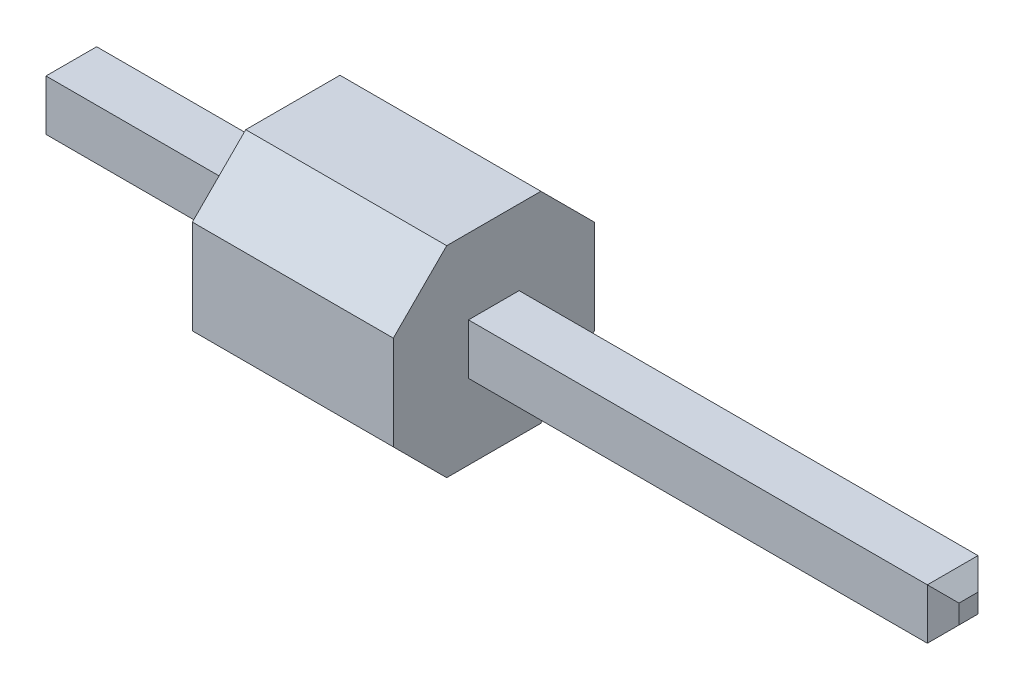
ISO-10303-21;
HEADER;
FILE_DESCRIPTION(('STEP AP214'),'2;1');
FILE_NAME('part.step','',(''),(''),'','','');
FILE_SCHEMA(('AUTOMOTIVE_DESIGN { 1 0 10303 214 1 1 1 1 }'));
ENDSEC;
DATA;
#1=APPLICATION_CONTEXT('core data for automotive mechanical design processes');
#2=APPLICATION_PROTOCOL_DEFINITION('international standard','automotive_design',2000,#1);
#3=PRODUCT_CONTEXT('',#1,'mechanical');
#4=PRODUCT('Part','Part','',(#3));
#5=PRODUCT_RELATED_PRODUCT_CATEGORY('part','',(#4));
#6=PRODUCT_DEFINITION_FORMATION('','',#4);
#7=PRODUCT_DEFINITION_CONTEXT('part definition',#1,'design');
#8=PRODUCT_DEFINITION('design','',#6,#7);
#9=PRODUCT_DEFINITION_SHAPE('','',#8);
#10=(LENGTH_UNIT() NAMED_UNIT(*) SI_UNIT(.MILLI.,.METRE.));
#11=(NAMED_UNIT(*) PLANE_ANGLE_UNIT() SI_UNIT($,.RADIAN.));
#12=(NAMED_UNIT(*) SI_UNIT($,.STERADIAN.) SOLID_ANGLE_UNIT());
#13=UNCERTAINTY_MEASURE_WITH_UNIT(LENGTH_MEASURE(1.E-05),#10,'distance_accuracy_value','');
#14=(GEOMETRIC_REPRESENTATION_CONTEXT(3) GLOBAL_UNCERTAINTY_ASSIGNED_CONTEXT((#13)) GLOBAL_UNIT_ASSIGNED_CONTEXT((#10,
#11,#12)) REPRESENTATION_CONTEXT('',''));
#15=CARTESIAN_POINT('',(0.,0.,0.));
#16=DIRECTION('',(0.,0.,1.));
#17=DIRECTION('',(1.,0.,0.));
#18=AXIS2_PLACEMENT_3D('',#15,#16,#17);
#19=CARTESIAN_POINT('',(-2.8,-0.32,-0.32));
#20=DIRECTION('',(0.707106781186548,0.,0.707106781186548));
#21=DIRECTION('',(0.707106781186548,0.,-0.707106781186548));
#22=AXIS2_PLACEMENT_3D('',#19,#20,#21);
#23=PLANE('',#22);
#24=DIRECTION('',(0.,1.,0.));
#25=VECTOR('',#24,1.);
#26=CARTESIAN_POINT('',(-2.8,-0.32,-0.32));
#27=LINE('',#26,#25);
#28=CARTESIAN_POINT('',(-2.8,-0.32,-0.32));
#29=VERTEX_POINT('',#28);
#30=CARTESIAN_POINT('',(-2.8,0.32,-0.32));
#31=VERTEX_POINT('',#30);
#32=EDGE_CURVE('P0_E104',#29,#31,#27,.T.);
#33=ORIENTED_EDGE('',*,*,#32,.F.);
#34=DIRECTION('',(-0.577350269189626,0.577350269189626,0.577350269189626));
#35=VECTOR('',#34,1.);
#36=CARTESIAN_POINT('',(-2.8,-0.32,-0.32));
#37=LINE('',#36,#35);
#38=CARTESIAN_POINT('',(-3.,-0.12,-0.12));
#39=VERTEX_POINT('',#38);
#40=EDGE_CURVE('P0_E79',#29,#39,#37,.T.);
#41=ORIENTED_EDGE('',*,*,#40,.T.);
#42=DIRECTION('',(0.,1.,0.));
#43=VECTOR('',#42,1.);
#44=CARTESIAN_POINT('',(-3.,0.,-0.12));
#45=LINE('',#44,#43);
#46=CARTESIAN_POINT('',(-3.,0.12,-0.12));
#47=VERTEX_POINT('',#46);
#48=EDGE_CURVE('P0_E20',#47,#39,#45,.F.);
#49=ORIENTED_EDGE('',*,*,#48,.F.);
#50=DIRECTION('',(0.577350269189626,0.577350269189626,-0.577350269189626));
#51=VECTOR('',#50,1.);
#52=CARTESIAN_POINT('',(-3.,0.12,-0.12));
#53=LINE('',#52,#51);
#54=EDGE_CURVE('P0_E83',#47,#31,#53,.T.);
#55=ORIENTED_EDGE('',*,*,#54,.T.);
#56=EDGE_LOOP('',(#33,#41,#49,#55));
#57=FACE_BOUND('',#56,.T.);
#58=ADVANCED_FACE('P0_F17',(#57),#23,.F.);
#59=CARTESIAN_POINT('',(8.54,0.,-0.12));
#60=DIRECTION('',(0.707106781186548,0.,-0.707106781186548));
#61=DIRECTION('',(-0.707106781186548,0.,-0.707106781186548));
#62=AXIS2_PLACEMENT_3D('',#59,#60,#61);
#63=PLANE('',#62);
#64=DIRECTION('',(-0.577350269189624,0.577350269189625,-0.577350269189628));
#65=VECTOR('',#64,1.);
#66=CARTESIAN_POINT('',(8.54,0.12,-0.12));
#67=LINE('',#66,#65);
#68=CARTESIAN_POINT('',(8.54,0.12,-0.12));
#69=VERTEX_POINT('',#68);
#70=CARTESIAN_POINT('',(8.34,0.32,-0.32));
#71=VERTEX_POINT('',#70);
#72=EDGE_CURVE('P0_E116',#69,#71,#67,.T.);
#73=ORIENTED_EDGE('',*,*,#72,.F.);
#74=DIRECTION('',(0.,1.,0.));
#75=VECTOR('',#74,1.);
#76=CARTESIAN_POINT('',(8.54,0.,-0.12));
#77=LINE('',#76,#75);
#78=CARTESIAN_POINT('',(8.54,-0.12,-0.12));
#79=VERTEX_POINT('',#78);
#80=EDGE_CURVE('P0_E113',#69,#79,#77,.F.);
#81=ORIENTED_EDGE('',*,*,#80,.T.);
#82=DIRECTION('',(0.577350269189624,0.577350269189625,0.577350269189628));
#83=VECTOR('',#82,1.);
#84=CARTESIAN_POINT('',(8.34,-0.319999999999999,-0.32));
#85=LINE('',#84,#83);
#86=CARTESIAN_POINT('',(8.34,-0.32,-0.32));
#87=VERTEX_POINT('',#86);
#88=EDGE_CURVE('P0_E109',#87,#79,#85,.T.);
#89=ORIENTED_EDGE('',*,*,#88,.F.);
#90=DIRECTION('',(0.,1.,0.));
#91=VECTOR('',#90,1.);
#92=CARTESIAN_POINT('',(8.34,-0.32,-0.32));
#93=LINE('',#92,#91);
#94=EDGE_CURVE('P0_E106',#71,#87,#93,.F.);
#95=ORIENTED_EDGE('',*,*,#94,.F.);
#96=EDGE_LOOP('',(#73,#81,#89,#95));
#97=FACE_BOUND('',#96,.T.);
#98=ADVANCED_FACE('P0_F182',(#97),#63,.T.);
#99=CARTESIAN_POINT('',(-3.,0.,0.));
#100=DIRECTION('',(-1.,0.,0.));
#101=DIRECTION('',(0.,0.,1.));
#102=AXIS2_PLACEMENT_3D('',#99,#100,#101);
#103=PLANE('',#102);
#104=DIRECTION('',(0.,1.,0.));
#105=VECTOR('',#104,1.);
#106=CARTESIAN_POINT('',(-3.,-0.32,0.12));
#107=LINE('',#106,#105);
#108=CARTESIAN_POINT('',(-3.,-0.12,0.12));
#109=VERTEX_POINT('',#108);
#110=CARTESIAN_POINT('',(-3.,0.12,0.12));
#111=VERTEX_POINT('',#110);
#112=EDGE_CURVE('P0_E91',#109,#111,#107,.T.);
#113=ORIENTED_EDGE('',*,*,#112,.T.);
#114=DIRECTION('',(0.,0.,1.));
#115=VECTOR('',#114,1.);
#116=CARTESIAN_POINT('',(-3.,0.12,0.32));
#117=LINE('',#116,#115);
#118=EDGE_CURVE('P0_E87',#111,#47,#117,.F.);
#119=ORIENTED_EDGE('',*,*,#118,.T.);
#120=ORIENTED_EDGE('',*,*,#48,.T.);
#121=DIRECTION('',(0.,0.,1.));
#122=VECTOR('',#121,1.);
#123=CARTESIAN_POINT('',(-3.,-0.12,0.32));
#124=LINE('',#123,#122);
#125=EDGE_CURVE('P0_E100',#39,#109,#124,.T.);
#126=ORIENTED_EDGE('',*,*,#125,.T.);
#127=EDGE_LOOP('',(#113,#119,#120,#126));
#128=FACE_BOUND('',#127,.T.);
#129=ADVANCED_FACE('P0_F89',(#128),#103,.T.);
#130=CARTESIAN_POINT('',(-2.8,0.32,0.32));
#131=DIRECTION('',(0.707106781186548,-0.707106781186548,0.));
#132=DIRECTION('',(0.707106781186548,0.707106781186548,0.));
#133=AXIS2_PLACEMENT_3D('',#130,#131,#132);
#134=PLANE('',#133);
#135=ORIENTED_EDGE('',*,*,#118,.F.);
#136=DIRECTION('',(0.577350269189626,0.577350269189626,0.577350269189626));
#137=VECTOR('',#136,1.);
#138=CARTESIAN_POINT('',(-3.,0.12,0.12));
#139=LINE('',#138,#137);
#140=CARTESIAN_POINT('',(-2.8,0.32,0.32));
#141=VERTEX_POINT('',#140);
#142=EDGE_CURVE('P0_E132',#111,#141,#139,.T.);
#143=ORIENTED_EDGE('',*,*,#142,.T.);
#144=DIRECTION('',(0.,0.,1.));
#145=VECTOR('',#144,1.);
#146=CARTESIAN_POINT('',(-2.8,0.32,0.32));
#147=LINE('',#146,#145);
#148=EDGE_CURVE('P0_E97',#31,#141,#147,.T.);
#149=ORIENTED_EDGE('',*,*,#148,.F.);
#150=ORIENTED_EDGE('',*,*,#54,.F.);
#151=EDGE_LOOP('',(#135,#143,#149,#150));
#152=FACE_BOUND('',#151,.T.);
#153=ADVANCED_FACE('P0_F95',(#152),#134,.F.);
#154=CARTESIAN_POINT('',(-2.8,-0.32,0.32));
#155=DIRECTION('',(0.707106781186548,0.707106781186548,0.));
#156=DIRECTION('',(-0.707106781186548,0.707106781186548,0.));
#157=AXIS2_PLACEMENT_3D('',#154,#155,#156);
#158=PLANE('',#157);
#159=ORIENTED_EDGE('',*,*,#125,.F.);
#160=ORIENTED_EDGE('',*,*,#40,.F.);
#161=DIRECTION('',(0.,0.,-1.));
#162=VECTOR('',#161,1.);
#163=CARTESIAN_POINT('',(-2.8,-0.32,0.32));
#164=LINE('',#163,#162);
#165=CARTESIAN_POINT('',(-2.8,-0.32,0.32));
#166=VERTEX_POINT('',#165);
#167=EDGE_CURVE('P0_E134',#166,#29,#164,.T.);
#168=ORIENTED_EDGE('',*,*,#167,.F.);
#169=DIRECTION('',(-0.577350269189626,0.577350269189626,-0.577350269189626));
#170=VECTOR('',#169,1.);
#171=CARTESIAN_POINT('',(-2.8,-0.32,0.32));
#172=LINE('',#171,#170);
#173=EDGE_CURVE('P0_E128',#166,#109,#172,.T.);
#174=ORIENTED_EDGE('',*,*,#173,.T.);
#175=EDGE_LOOP('',(#159,#160,#168,#174));
#176=FACE_BOUND('',#175,.T.);
#177=ADVANCED_FACE('P0_F178',(#176),#158,.F.);
#178=CARTESIAN_POINT('',(-3.,-0.32,-0.32));
#179=DIRECTION('',(0.,0.,-1.));
#180=DIRECTION('',(-1.,0.,0.));
#181=AXIS2_PLACEMENT_3D('',#178,#179,#180);
#182=PLANE('',#181);
#183=DIRECTION('',(1.,0.,0.));
#184=VECTOR('',#183,1.);
#185=CARTESIAN_POINT('',(-3.,0.32,-0.32));
#186=LINE('',#185,#184);
#187=EDGE_CURVE('P0_E122',#71,#31,#186,.F.);
#188=ORIENTED_EDGE('',*,*,#187,.F.);
#189=ORIENTED_EDGE('',*,*,#94,.T.);
#190=DIRECTION('',(1.,0.,0.));
#191=VECTOR('',#190,1.);
#192=CARTESIAN_POINT('',(-3.,-0.32,-0.32));
#193=LINE('',#192,#191);
#194=EDGE_CURVE('P0_E137',#29,#87,#193,.T.);
#195=ORIENTED_EDGE('',*,*,#194,.F.);
#196=ORIENTED_EDGE('',*,*,#32,.T.);
#197=EDGE_LOOP('',(#188,#189,#195,#196));
#198=FACE_BOUND('',#197,.T.);
#199=ADVANCED_FACE('P0_F180',(#198),#182,.T.);
#200=CARTESIAN_POINT('',(8.54,-0.12,0.));
#201=DIRECTION('',(0.707106781186548,-0.707106781186548,0.));
#202=DIRECTION('',(0.707106781186548,0.707106781186548,0.));
#203=AXIS2_PLACEMENT_3D('',#200,#201,#202);
#204=PLANE('',#203);
#205=ORIENTED_EDGE('',*,*,#88,.T.);
#206=DIRECTION('',(0.,0.,1.));
#207=VECTOR('',#206,1.);
#208=CARTESIAN_POINT('',(8.54,-0.12,0.));
#209=LINE('',#208,#207);
#210=CARTESIAN_POINT('',(8.54,-0.12,0.12));
#211=VERTEX_POINT('',#210);
#212=EDGE_CURVE('P0_E111',#79,#211,#209,.T.);
#213=ORIENTED_EDGE('',*,*,#212,.T.);
#214=DIRECTION('',(0.577350269189624,0.577350269189628,-0.577350269189625));
#215=VECTOR('',#214,1.);
#216=CARTESIAN_POINT('',(8.34,-0.32,0.319999999999999));
#217=LINE('',#216,#215);
#218=CARTESIAN_POINT('',(8.34,-0.32,0.32));
#219=VERTEX_POINT('',#218);
#220=EDGE_CURVE('P0_E35',#219,#211,#217,.T.);
#221=ORIENTED_EDGE('',*,*,#220,.F.);
#222=DIRECTION('',(0.,0.,-1.));
#223=VECTOR('',#222,1.);
#224=CARTESIAN_POINT('',(8.34,-0.32,0.32));
#225=LINE('',#224,#223);
#226=EDGE_CURVE('P0_E140',#87,#219,#225,.F.);
#227=ORIENTED_EDGE('',*,*,#226,.F.);
#228=EDGE_LOOP('',(#205,#213,#221,#227));
#229=FACE_BOUND('',#228,.T.);
#230=ADVANCED_FACE('P0_F185',(#229),#204,.T.);
#231=CARTESIAN_POINT('',(8.54,0.,0.));
#232=DIRECTION('',(-1.,0.,0.));
#233=DIRECTION('',(0.,0.,1.));
#234=AXIS2_PLACEMENT_3D('',#231,#232,#233);
#235=PLANE('',#234);
#236=DIRECTION('',(0.,0.,1.));
#237=VECTOR('',#236,1.);
#238=CARTESIAN_POINT('',(8.54,0.12,0.));
#239=LINE('',#238,#237);
#240=CARTESIAN_POINT('',(8.54,0.12,0.12));
#241=VERTEX_POINT('',#240);
#242=EDGE_CURVE('P0_E119',#241,#69,#239,.F.);
#243=ORIENTED_EDGE('',*,*,#242,.F.);
#244=DIRECTION('',(0.,1.,0.));
#245=VECTOR('',#244,1.);
#246=CARTESIAN_POINT('',(8.54,0.,0.12));
#247=LINE('',#246,#245);
#248=EDGE_CURVE('P0_E143',#211,#241,#247,.T.);
#249=ORIENTED_EDGE('',*,*,#248,.F.);
#250=ORIENTED_EDGE('',*,*,#212,.F.);
#251=ORIENTED_EDGE('',*,*,#80,.F.);
#252=EDGE_LOOP('',(#243,#249,#250,#251));
#253=FACE_BOUND('',#252,.T.);
#254=ADVANCED_FACE('P0_F187',(#253),#235,.F.);
#255=CARTESIAN_POINT('',(8.54,0.12,0.));
#256=DIRECTION('',(0.707106781186548,0.707106781186548,0.));
#257=DIRECTION('',(-0.707106781186548,0.707106781186548,0.));
#258=AXIS2_PLACEMENT_3D('',#255,#256,#257);
#259=PLANE('',#258);
#260=DIRECTION('',(-0.577350269189624,0.577350269189628,0.577350269189625));
#261=VECTOR('',#260,1.);
#262=CARTESIAN_POINT('',(8.54,0.12,0.12));
#263=LINE('',#262,#261);
#264=CARTESIAN_POINT('',(8.34,0.32,0.32));
#265=VERTEX_POINT('',#264);
#266=EDGE_CURVE('P0_E146',#241,#265,#263,.T.);
#267=ORIENTED_EDGE('',*,*,#266,.F.);
#268=ORIENTED_EDGE('',*,*,#242,.T.);
#269=ORIENTED_EDGE('',*,*,#72,.T.);
#270=DIRECTION('',(0.,0.,1.));
#271=VECTOR('',#270,1.);
#272=CARTESIAN_POINT('',(8.34,0.32,0.32));
#273=LINE('',#272,#271);
#274=EDGE_CURVE('P0_E125',#265,#71,#273,.F.);
#275=ORIENTED_EDGE('',*,*,#274,.F.);
#276=EDGE_LOOP('',(#267,#268,#269,#275));
#277=FACE_BOUND('',#276,.T.);
#278=ADVANCED_FACE('P0_F169',(#277),#259,.T.);
#279=CARTESIAN_POINT('',(-3.,0.32,0.32));
#280=DIRECTION('',(0.,1.,0.));
#281=DIRECTION('',(0.,0.,1.));
#282=AXIS2_PLACEMENT_3D('',#279,#280,#281);
#283=PLANE('',#282);
#284=DIRECTION('',(1.,0.,0.));
#285=VECTOR('',#284,1.);
#286=CARTESIAN_POINT('',(-3.,0.32,0.32));
#287=LINE('',#286,#285);
#288=EDGE_CURVE('P0_E149',#265,#141,#287,.F.);
#289=ORIENTED_EDGE('',*,*,#288,.F.);
#290=ORIENTED_EDGE('',*,*,#274,.T.);
#291=ORIENTED_EDGE('',*,*,#187,.T.);
#292=ORIENTED_EDGE('',*,*,#148,.T.);
#293=EDGE_LOOP('',(#289,#290,#291,#292));
#294=FACE_BOUND('',#293,.T.);
#295=ADVANCED_FACE('P0_F172',(#294),#283,.T.);
#296=CARTESIAN_POINT('',(-2.8,-0.32,0.32));
#297=DIRECTION('',(0.707106781186548,0.,-0.707106781186548));
#298=DIRECTION('',(-0.707106781186548,0.,-0.707106781186548));
#299=AXIS2_PLACEMENT_3D('',#296,#297,#298);
#300=PLANE('',#299);
#301=ORIENTED_EDGE('',*,*,#112,.F.);
#302=ORIENTED_EDGE('',*,*,#173,.F.);
#303=DIRECTION('',(0.,1.,0.));
#304=VECTOR('',#303,1.);
#305=CARTESIAN_POINT('',(-2.8,-0.32,0.32));
#306=LINE('',#305,#304);
#307=EDGE_CURVE('P0_E152',#141,#166,#306,.F.);
#308=ORIENTED_EDGE('',*,*,#307,.F.);
#309=ORIENTED_EDGE('',*,*,#142,.F.);
#310=EDGE_LOOP('',(#301,#302,#308,#309));
#311=FACE_BOUND('',#310,.T.);
#312=ADVANCED_FACE('P0_F176',(#311),#300,.F.);
#313=CARTESIAN_POINT('',(-3.,-0.32,0.32));
#314=DIRECTION('',(0.,-1.,0.));
#315=DIRECTION('',(0.,0.,-1.));
#316=AXIS2_PLACEMENT_3D('',#313,#314,#315);
#317=PLANE('',#316);
#318=ORIENTED_EDGE('',*,*,#194,.T.);
#319=ORIENTED_EDGE('',*,*,#226,.T.);
#320=DIRECTION('',(1.,0.,0.));
#321=VECTOR('',#320,1.);
#322=CARTESIAN_POINT('',(-3.,-0.32,0.32));
#323=LINE('',#322,#321);
#324=EDGE_CURVE('P0_E26',#166,#219,#323,.T.);
#325=ORIENTED_EDGE('',*,*,#324,.F.);
#326=ORIENTED_EDGE('',*,*,#167,.T.);
#327=EDGE_LOOP('',(#318,#319,#325,#326));
#328=FACE_BOUND('',#327,.T.);
#329=ADVANCED_FACE('P0_F162',(#328),#317,.T.);
#330=CARTESIAN_POINT('',(8.54,0.,0.12));
#331=DIRECTION('',(0.707106781186548,0.,0.707106781186548));
#332=DIRECTION('',(0.707106781186548,0.,-0.707106781186548));
#333=AXIS2_PLACEMENT_3D('',#330,#331,#332);
#334=PLANE('',#333);
#335=ORIENTED_EDGE('',*,*,#266,.T.);
#336=DIRECTION('',(0.,1.,0.));
#337=VECTOR('',#336,1.);
#338=CARTESIAN_POINT('',(8.34,-0.32,0.32));
#339=LINE('',#338,#337);
#340=EDGE_CURVE('P0_E11',#219,#265,#339,.T.);
#341=ORIENTED_EDGE('',*,*,#340,.F.);
#342=ORIENTED_EDGE('',*,*,#220,.T.);
#343=ORIENTED_EDGE('',*,*,#248,.T.);
#344=EDGE_LOOP('',(#335,#341,#342,#343));
#345=FACE_BOUND('',#344,.T.);
#346=ADVANCED_FACE('P0_F165',(#345),#334,.T.);
#347=CARTESIAN_POINT('',(-3.,-0.32,0.32));
#348=DIRECTION('',(0.,0.,1.));
#349=DIRECTION('',(1.,0.,0.));
#350=AXIS2_PLACEMENT_3D('',#347,#348,#349);
#351=PLANE('',#350);
#352=ORIENTED_EDGE('',*,*,#324,.T.);
#353=ORIENTED_EDGE('',*,*,#340,.T.);
#354=ORIENTED_EDGE('',*,*,#288,.T.);
#355=ORIENTED_EDGE('',*,*,#307,.T.);
#356=EDGE_LOOP('',(#352,#353,#354,#355));
#357=FACE_BOUND('',#356,.T.);
#358=ADVANCED_FACE('P0_F158',(#357),#351,.T.);
#359=CLOSED_SHELL('',(#58,#98,#129,#153,#177,#199,#230,#254,#278,#295,#312,#329,#346,#358));
#360=MANIFOLD_SOLID_BREP('P0_B1',#359);
#361=CARTESIAN_POINT('',(2.54,0.9327413415,0.9327413415));
#362=DIRECTION('',(0.,-0.707106781186548,-0.707106781186548));
#363=DIRECTION('',(0.,0.707106781186548,-0.707106781186548));
#364=AXIS2_PLACEMENT_3D('',#361,#362,#363);
#365=PLANE('',#364);
#366=DIRECTION('',(-1.,0.,0.));
#367=VECTOR('',#366,1.);
#368=CARTESIAN_POINT('',(2.54,0.595482683,1.27));
#369=LINE('',#368,#367);
#370=CARTESIAN_POINT('',(0.,0.595482683,1.27));
#371=VERTEX_POINT('',#370);
#372=CARTESIAN_POINT('',(2.54,0.595482683,1.27));
#373=VERTEX_POINT('',#372);
#374=EDGE_CURVE('P1_E168',#371,#373,#369,.F.);
#375=ORIENTED_EDGE('',*,*,#374,.T.);
#376=DIRECTION('',(0.,0.707106781186548,-0.707106781186548));
#377=VECTOR('',#376,1.);
#378=CARTESIAN_POINT('',(2.54,0.9327413415,0.9327413415));
#379=LINE('',#378,#377);
#380=CARTESIAN_POINT('',(2.54,1.27,0.595482683));
#381=VERTEX_POINT('',#380);
#382=EDGE_CURVE('P1_E150',#381,#373,#379,.F.);
#383=ORIENTED_EDGE('',*,*,#382,.F.);
#384=DIRECTION('',(1.,0.,0.));
#385=VECTOR('',#384,1.);
#386=CARTESIAN_POINT('',(2.54,1.27,0.595482683));
#387=LINE('',#386,#385);
#388=CARTESIAN_POINT('',(0.,1.27,0.595482683));
#389=VERTEX_POINT('',#388);
#390=EDGE_CURVE('P1_E163',#381,#389,#387,.F.);
#391=ORIENTED_EDGE('',*,*,#390,.T.);
#392=DIRECTION('',(0.,0.707106781186548,-0.707106781186548));
#393=VECTOR('',#392,1.);
#394=CARTESIAN_POINT('',(0.,0.9327413415,0.9327413415));
#395=LINE('',#394,#393);
#396=EDGE_CURVE('P1_E152',#371,#389,#395,.T.);
#397=ORIENTED_EDGE('',*,*,#396,.F.);
#398=EDGE_LOOP('',(#375,#383,#391,#397));
#399=FACE_BOUND('',#398,.T.);
#400=ADVANCED_FACE('P1_F16',(#399),#365,.F.);
#401=CARTESIAN_POINT('',(2.54,1.27,0.));
#402=DIRECTION('',(0.,-1.,0.));
#403=DIRECTION('',(0.,0.,-1.));
#404=AXIS2_PLACEMENT_3D('',#401,#402,#403);
#405=PLANE('',#404);
#406=ORIENTED_EDGE('',*,*,#390,.F.);
#407=DIRECTION('',(0.,0.,-1.));
#408=VECTOR('',#407,1.);
#409=CARTESIAN_POINT('',(2.54,1.27,0.));
#410=LINE('',#409,#408);
#411=CARTESIAN_POINT('',(2.54,1.27,-0.595482683));
#412=VERTEX_POINT('',#411);
#413=EDGE_CURVE('P1_E154',#412,#381,#410,.F.);
#414=ORIENTED_EDGE('',*,*,#413,.F.);
#415=DIRECTION('',(1.,0.,0.));
#416=VECTOR('',#415,1.);
#417=CARTESIAN_POINT('',(2.54,1.27,-0.595482683));
#418=LINE('',#417,#416);
#419=CARTESIAN_POINT('',(0.,1.27,-0.595482683));
#420=VERTEX_POINT('',#419);
#421=EDGE_CURVE('P1_E147',#412,#420,#418,.F.);
#422=ORIENTED_EDGE('',*,*,#421,.T.);
#423=DIRECTION('',(0.,0.,-1.));
#424=VECTOR('',#423,1.);
#425=CARTESIAN_POINT('',(0.,1.27,0.));
#426=LINE('',#425,#424);
#427=EDGE_CURVE('P1_E166',#389,#420,#426,.T.);
#428=ORIENTED_EDGE('',*,*,#427,.F.);
#429=EDGE_LOOP('',(#406,#414,#422,#428));
#430=FACE_BOUND('',#429,.T.);
#431=ADVANCED_FACE('P1_F330',(#430),#405,.F.);
#432=CARTESIAN_POINT('',(2.54,0.,1.27));
#433=DIRECTION('',(0.,0.,-1.));
#434=DIRECTION('',(-1.,0.,0.));
#435=AXIS2_PLACEMENT_3D('',#432,#433,#434);
#436=PLANE('',#435);
#437=DIRECTION('',(1.,0.,0.));
#438=VECTOR('',#437,1.);
#439=CARTESIAN_POINT('',(2.54,-0.595482683,1.27));
#440=LINE('',#439,#438);
#441=CARTESIAN_POINT('',(2.54,-0.595482683,1.27));
#442=VERTEX_POINT('',#441);
#443=CARTESIAN_POINT('',(0.,-0.595482683,1.27));
#444=VERTEX_POINT('',#443);
#445=EDGE_CURVE('P1_E207',#442,#444,#440,.F.);
#446=ORIENTED_EDGE('',*,*,#445,.F.);
#447=DIRECTION('',(0.,1.,0.));
#448=VECTOR('',#447,1.);
#449=CARTESIAN_POINT('',(2.54,0.,1.27));
#450=LINE('',#449,#448);
#451=EDGE_CURVE('P1_E181',#373,#442,#450,.F.);
#452=ORIENTED_EDGE('',*,*,#451,.F.);
#453=ORIENTED_EDGE('',*,*,#374,.F.);
#454=DIRECTION('',(0.,1.,0.));
#455=VECTOR('',#454,1.);
#456=CARTESIAN_POINT('',(0.,0.,1.27));
#457=LINE('',#456,#455);
#458=EDGE_CURVE('P1_E183',#444,#371,#457,.T.);
#459=ORIENTED_EDGE('',*,*,#458,.F.);
#460=EDGE_LOOP('',(#446,#452,#453,#459));
#461=FACE_BOUND('',#460,.T.);
#462=ADVANCED_FACE('P1_F337',(#461),#436,.F.);
#463=CARTESIAN_POINT('',(2.54,0.32,0.));
#464=DIRECTION('',(0.,-1.,0.));
#465=DIRECTION('',(0.,0.,-1.));
#466=AXIS2_PLACEMENT_3D('',#463,#464,#465);
#467=PLANE('',#466);
#468=DIRECTION('',(0.,0.,-1.));
#469=VECTOR('',#468,1.);
#470=CARTESIAN_POINT('',(2.54,0.32,0.));
#471=LINE('',#470,#469);
#472=CARTESIAN_POINT('',(2.54,0.32,-0.32));
#473=VERTEX_POINT('',#472);
#474=CARTESIAN_POINT('',(2.54,0.32,0.32));
#475=VERTEX_POINT('',#474);
#476=EDGE_CURVE('P1_E132',#473,#475,#471,.F.);
#477=ORIENTED_EDGE('',*,*,#476,.T.);
#478=DIRECTION('',(1.,0.,0.));
#479=VECTOR('',#478,1.);
#480=CARTESIAN_POINT('',(2.54,0.32,0.32));
#481=LINE('',#480,#479);
#482=CARTESIAN_POINT('',(0.,0.32,0.32));
#483=VERTEX_POINT('',#482);
#484=EDGE_CURVE('P1_E215',#483,#475,#481,.T.);
#485=ORIENTED_EDGE('',*,*,#484,.F.);
#486=DIRECTION('',(0.,0.,-1.));
#487=VECTOR('',#486,1.);
#488=CARTESIAN_POINT('',(0.,0.32,0.));
#489=LINE('',#488,#487);
#490=CARTESIAN_POINT('',(0.,0.32,-0.32));
#491=VERTEX_POINT('',#490);
#492=EDGE_CURVE('P1_E186',#483,#491,#489,.T.);
#493=ORIENTED_EDGE('',*,*,#492,.T.);
#494=DIRECTION('',(1.,0.,0.));
#495=VECTOR('',#494,1.);
#496=CARTESIAN_POINT('',(2.54,0.32,-0.32));
#497=LINE('',#496,#495);
#498=EDGE_CURVE('P1_E210',#491,#473,#497,.T.);
#499=ORIENTED_EDGE('',*,*,#498,.T.);
#500=EDGE_LOOP('',(#477,#485,#493,#499));
#501=FACE_BOUND('',#500,.T.);
#502=ADVANCED_FACE('P1_F277',(#501),#467,.T.);
#503=CARTESIAN_POINT('',(0.457528496239,2.54,-1.152068397165));
#504=DIRECTION('',(-0.410022520076835,0.,-0.912075398763634));
#505=DIRECTION('',(-0.912075398763634,0.,0.410022520076835));
#506=AXIS2_PLACEMENT_3D('',#503,#504,#505);
#507=PLANE('',#506);
#508=DIRECTION('',(-0.843892829702957,-0.379371119074516,0.379371119074826));
#509=VECTOR('',#508,1.);
#510=CARTESIAN_POINT('',(0.457528496239,-0.713414285835002,-1.152068397165));
#511=LINE('',#510,#509);
#512=CARTESIAN_POINT('',(0.457528496239304,-0.713414285834686,-1.15206839716538));
#513=VERTEX_POINT('',#512);
#514=CARTESIAN_POINT('',(0.,-0.919095732006001,-0.946386950993916));
#515=VERTEX_POINT('',#514);
#516=EDGE_CURVE('P1_E119',#513,#515,#511,.T.);
#517=ORIENTED_EDGE('',*,*,#516,.T.);
#518=DIRECTION('',(0.,1.,0.));
#519=VECTOR('',#518,1.);
#520=CARTESIAN_POINT('',(0.,0.,-0.946386950994));
#521=LINE('',#520,#519);
#522=CARTESIAN_POINT('',(0.,0.919095732006,-0.946386950994));
#523=VERTEX_POINT('',#522);
#524=EDGE_CURVE('P1_E158',#515,#523,#521,.T.);
#525=ORIENTED_EDGE('',*,*,#524,.T.);
#526=DIRECTION('',(0.843892829703096,-0.379371119074517,-0.379371119074517));
#527=VECTOR('',#526,1.);
#528=CARTESIAN_POINT('',(0.,0.919095732006,-0.946386950994));
#529=LINE('',#528,#527);
#530=CARTESIAN_POINT('',(0.457528496239294,0.713414285834689,-1.15206839716538));
#531=VERTEX_POINT('',#530);
#532=EDGE_CURVE('P1_E136',#523,#531,#529,.T.);
#533=ORIENTED_EDGE('',*,*,#532,.T.);
#534=DIRECTION('',(0.,-1.,0.));
#535=VECTOR('',#534,1.);
#536=CARTESIAN_POINT('',(0.457528496238877,2.54,-1.15206839716527));
#537=LINE('',#536,#535);
#538=EDGE_CURVE('P1_E131',#531,#513,#537,.T.);
#539=ORIENTED_EDGE('',*,*,#538,.T.);
#540=EDGE_LOOP('',(#517,#525,#533,#539));
#541=FACE_BOUND('',#540,.T.);
#542=ADVANCED_FACE('P1_F135',(#541),#507,.T.);
#543=CARTESIAN_POINT('',(0.416526244232,2.54,-1.243275937042));
#544=DIRECTION('',(0.,-1.,0.));
#545=DIRECTION('',(0.,0.,-1.));
#546=AXIS2_PLACEMENT_3D('',#543,#544,#545);
#547=CYLINDRICAL_SURFACE('',#546,0.1);
#548=DIRECTION('',(0.,1.,0.));
#549=VECTOR('',#548,1.);
#550=CARTESIAN_POINT('',(0.516526244232,2.54,-1.243275937042));
#551=LINE('',#550,#549);
#552=CARTESIAN_POINT('',(0.516526244232,-0.622206745958,-1.243275937042));
#553=VERTEX_POINT('',#552);
#554=CARTESIAN_POINT('',(0.516526244232,0.622206745958001,-1.243275937042));
#555=VERTEX_POINT('',#554);
#556=EDGE_CURVE('P1_E142',#553,#555,#551,.T.);
#557=ORIENTED_EDGE('',*,*,#556,.F.);
#558=CARTESIAN_POINT('',(0.416526244232,-0.622206745958,-1.243275937042));
#559=DIRECTION('',(0.,-0.707106781186548,-0.707106781186548));
#560=DIRECTION('',(0.,-0.707106781186548,0.707106781186548));
#561=AXIS2_PLACEMENT_3D('',#558,#559,#560);
#562=ELLIPSE('',#561,0.14142135623731,0.1);
#563=EDGE_CURVE('P1_E19',#513,#553,#562,.F.);
#564=ORIENTED_EDGE('',*,*,#563,.F.);
#565=ORIENTED_EDGE('',*,*,#538,.F.);
#566=CARTESIAN_POINT('',(0.416526244232,0.622206745958,-1.243275937042));
#567=DIRECTION('',(0.,-0.707106781186548,0.707106781186548));
#568=DIRECTION('',(0.,-0.707106781186548,-0.707106781186548));
#569=AXIS2_PLACEMENT_3D('',#566,#567,#568);
#570=ELLIPSE('',#569,0.14142135623731,0.1);
#571=EDGE_CURVE('P1_E144',#531,#555,#570,.F.);
#572=ORIENTED_EDGE('',*,*,#571,.T.);
#573=EDGE_LOOP('',(#557,#564,#565,#572));
#574=FACE_BOUND('',#573,.T.);
#575=ADVANCED_FACE('P1_F140',(#574),#547,.F.);
#576=CARTESIAN_POINT('',(2.54,0.9327413415,-0.9327413415));
#577=DIRECTION('',(0.,-0.707106781186548,0.707106781186548));
#578=DIRECTION('',(0.,-0.707106781186548,-0.707106781186548));
#579=AXIS2_PLACEMENT_3D('',#576,#577,#578);
#580=PLANE('',#579);
#581=DIRECTION('',(0.,0.707106781186547,0.707106781186548));
#582=VECTOR('',#581,1.);
#583=CARTESIAN_POINT('',(0.,0.919095732006,-0.946386950994));
#584=LINE('',#583,#582);
#585=EDGE_CURVE('P1_E171',#523,#420,#584,.T.);
#586=ORIENTED_EDGE('',*,*,#585,.T.);
#587=ORIENTED_EDGE('',*,*,#421,.F.);
#588=DIRECTION('',(0.,-0.707106781186548,-0.707106781186548));
#589=VECTOR('',#588,1.);
#590=CARTESIAN_POINT('',(2.54,0.9327413415,-0.9327413415));
#591=LINE('',#590,#589);
#592=CARTESIAN_POINT('',(2.54,0.595482683,-1.27));
#593=VERTEX_POINT('',#592);
#594=EDGE_CURVE('P1_E145',#593,#412,#591,.F.);
#595=ORIENTED_EDGE('',*,*,#594,.F.);
#596=DIRECTION('',(-1.,0.,0.));
#597=VECTOR('',#596,1.);
#598=CARTESIAN_POINT('',(2.54,0.595482683,-1.27));
#599=LINE('',#598,#597);
#600=CARTESIAN_POINT('',(0.516526244232,0.595482683,-1.27));
#601=VERTEX_POINT('',#600);
#602=EDGE_CURVE('P1_E191',#601,#593,#599,.F.);
#603=ORIENTED_EDGE('',*,*,#602,.F.);
#604=DIRECTION('',(0.,-0.707106781186545,-0.70710678118655));
#605=VECTOR('',#604,1.);
#606=CARTESIAN_POINT('',(0.516526244232,0.622206745958,-1.243275937042));
#607=LINE('',#606,#605);
#608=EDGE_CURVE('P1_E178',#555,#601,#607,.T.);
#609=ORIENTED_EDGE('',*,*,#608,.F.);
#610=ORIENTED_EDGE('',*,*,#571,.F.);
#611=ORIENTED_EDGE('',*,*,#532,.F.);
#612=EDGE_LOOP('',(#586,#587,#595,#603,#609,#610,#611));
#613=FACE_BOUND('',#612,.T.);
#614=ADVANCED_FACE('P1_F289',(#613),#580,.F.);
#615=CARTESIAN_POINT('',(2.54,-0.9327413415,0.9327413415));
#616=DIRECTION('',(0.,-0.707106781186548,0.707106781186548));
#617=DIRECTION('',(0.,-0.707106781186548,-0.707106781186548));
#618=AXIS2_PLACEMENT_3D('',#615,#616,#617);
#619=PLANE('',#618);
#620=DIRECTION('',(0.,-0.707106781186548,-0.707106781186548));
#621=VECTOR('',#620,1.);
#622=CARTESIAN_POINT('',(2.54,-0.9327413415,0.9327413415));
#623=LINE('',#622,#621);
#624=CARTESIAN_POINT('',(2.54,-1.27,0.595482683));
#625=VERTEX_POINT('',#624);
#626=EDGE_CURVE('P1_E204',#625,#442,#623,.F.);
#627=ORIENTED_EDGE('',*,*,#626,.T.);
#628=ORIENTED_EDGE('',*,*,#445,.T.);
#629=DIRECTION('',(0.,-0.707106781186548,-0.707106781186548));
#630=VECTOR('',#629,1.);
#631=CARTESIAN_POINT('',(0.,-0.595482683,1.27));
#632=LINE('',#631,#630);
#633=CARTESIAN_POINT('',(0.,-1.27,0.595482683));
#634=VERTEX_POINT('',#633);
#635=EDGE_CURVE('P1_E159',#444,#634,#632,.T.);
#636=ORIENTED_EDGE('',*,*,#635,.T.);
#637=DIRECTION('',(1.,0.,0.));
#638=VECTOR('',#637,1.);
#639=CARTESIAN_POINT('',(2.54,-1.27,0.595482683));
#640=LINE('',#639,#638);
#641=EDGE_CURVE('P1_E242',#625,#634,#640,.F.);
#642=ORIENTED_EDGE('',*,*,#641,.F.);
#643=EDGE_LOOP('',(#627,#628,#636,#642));
#644=FACE_BOUND('',#643,.T.);
#645=ADVANCED_FACE('P1_F281',(#644),#619,.T.);
#646=CARTESIAN_POINT('',(2.54,0.,-0.32));
#647=DIRECTION('',(0.,0.,-1.));
#648=DIRECTION('',(0.,1.,0.));
#649=AXIS2_PLACEMENT_3D('',#646,#647,#648);
#650=PLANE('',#649);
#651=DIRECTION('',(1.,0.,0.));
#652=VECTOR('',#651,1.);
#653=CARTESIAN_POINT('',(2.54,-0.32,-0.32));
#654=LINE('',#653,#652);
#655=CARTESIAN_POINT('',(0.,-0.32,-0.32));
#656=VERTEX_POINT('',#655);
#657=CARTESIAN_POINT('',(2.54,-0.32,-0.32));
#658=VERTEX_POINT('',#657);
#659=EDGE_CURVE('P1_E245',#656,#658,#654,.T.);
#660=ORIENTED_EDGE('',*,*,#659,.T.);
#661=DIRECTION('',(0.,1.,0.));
#662=VECTOR('',#661,1.);
#663=CARTESIAN_POINT('',(2.54,0.,-0.32));
#664=LINE('',#663,#662);
#665=EDGE_CURVE('P1_E213',#473,#658,#664,.F.);
#666=ORIENTED_EDGE('',*,*,#665,.F.);
#667=ORIENTED_EDGE('',*,*,#498,.F.);
#668=DIRECTION('',(0.,1.,0.));
#669=VECTOR('',#668,1.);
#670=CARTESIAN_POINT('',(0.,0.,-0.32));
#671=LINE('',#670,#669);
#672=EDGE_CURVE('P1_E220',#491,#656,#671,.F.);
#673=ORIENTED_EDGE('',*,*,#672,.T.);
#674=EDGE_LOOP('',(#660,#666,#667,#673));
#675=FACE_BOUND('',#674,.T.);
#676=ADVANCED_FACE('P1_F279',(#675),#650,.F.);
#677=CARTESIAN_POINT('',(2.54,0.,0.32));
#678=DIRECTION('',(0.,0.,-1.));
#679=DIRECTION('',(0.,1.,0.));
#680=AXIS2_PLACEMENT_3D('',#677,#678,#679);
#681=PLANE('',#680);
#682=DIRECTION('',(0.,1.,0.));
#683=VECTOR('',#682,1.);
#684=CARTESIAN_POINT('',(2.54,0.,0.32));
#685=LINE('',#684,#683);
#686=CARTESIAN_POINT('',(2.54,-0.32,0.32));
#687=VERTEX_POINT('',#686);
#688=EDGE_CURVE('P1_E218',#475,#687,#685,.F.);
#689=ORIENTED_EDGE('',*,*,#688,.T.);
#690=DIRECTION('',(1.,0.,0.));
#691=VECTOR('',#690,1.);
#692=CARTESIAN_POINT('',(2.54,-0.32,0.32));
#693=LINE('',#692,#691);
#694=CARTESIAN_POINT('',(0.,-0.32,0.32));
#695=VERTEX_POINT('',#694);
#696=EDGE_CURVE('P1_E248',#687,#695,#693,.F.);
#697=ORIENTED_EDGE('',*,*,#696,.T.);
#698=DIRECTION('',(0.,1.,0.));
#699=VECTOR('',#698,1.);
#700=CARTESIAN_POINT('',(0.,0.,0.32));
#701=LINE('',#700,#699);
#702=EDGE_CURVE('P1_E174',#695,#483,#701,.T.);
#703=ORIENTED_EDGE('',*,*,#702,.T.);
#704=ORIENTED_EDGE('',*,*,#484,.T.);
#705=EDGE_LOOP('',(#689,#697,#703,#704));
#706=FACE_BOUND('',#705,.T.);
#707=ADVANCED_FACE('P1_F270',(#706),#681,.T.);
#708=CARTESIAN_POINT('',(0.,0.,0.));
#709=DIRECTION('',(1.,0.,0.));
#710=DIRECTION('',(0.,0.,-1.));
#711=AXIS2_PLACEMENT_3D('',#708,#709,#710);
#712=PLANE('',#711);
#713=DIRECTION('',(0.,0.707106781186547,-0.707106781186548));
#714=VECTOR('',#713,1.);
#715=CARTESIAN_POINT('',(0.,-1.27,-0.595482683));
#716=LINE('',#715,#714);
#717=CARTESIAN_POINT('',(0.,-1.27,-0.595482683));
#718=VERTEX_POINT('',#717);
#719=EDGE_CURVE('P1_E127',#718,#515,#716,.T.);
#720=ORIENTED_EDGE('',*,*,#719,.F.);
#721=DIRECTION('',(0.,0.,-1.));
#722=VECTOR('',#721,1.);
#723=CARTESIAN_POINT('',(0.,-1.27,0.));
#724=LINE('',#723,#722);
#725=EDGE_CURVE('P1_E238',#634,#718,#724,.T.);
#726=ORIENTED_EDGE('',*,*,#725,.F.);
#727=ORIENTED_EDGE('',*,*,#635,.F.);
#728=ORIENTED_EDGE('',*,*,#458,.T.);
#729=ORIENTED_EDGE('',*,*,#396,.T.);
#730=ORIENTED_EDGE('',*,*,#427,.T.);
#731=ORIENTED_EDGE('',*,*,#585,.F.);
#732=ORIENTED_EDGE('',*,*,#524,.F.);
#733=EDGE_LOOP('',(#720,#726,#727,#728,#729,#730,#731,#732));
#734=FACE_BOUND('',#733,.T.);
#735=DIRECTION('',(0.,0.,-1.));
#736=VECTOR('',#735,1.);
#737=CARTESIAN_POINT('',(0.,-0.32,0.));
#738=LINE('',#737,#736);
#739=EDGE_CURVE('P1_E250',#695,#656,#738,.T.);
#740=ORIENTED_EDGE('',*,*,#739,.T.);
#741=ORIENTED_EDGE('',*,*,#672,.F.);
#742=ORIENTED_EDGE('',*,*,#492,.F.);
#743=ORIENTED_EDGE('',*,*,#702,.F.);
#744=EDGE_LOOP('',(#740,#741,#742,#743));
#745=FACE_BOUND('',#744,.T.);
#746=ADVANCED_FACE('P1_F272',(#734,#745),#712,.F.);
#747=CARTESIAN_POINT('',(0.516526244232,2.54,-1.243275937042));
#748=DIRECTION('',(-1.,0.,0.));
#749=DIRECTION('',(0.,0.,1.));
#750=AXIS2_PLACEMENT_3D('',#747,#748,#749);
#751=PLANE('',#750);
#752=DIRECTION('',(0.,0.707106781186548,-0.707106781186548));
#753=VECTOR('',#752,1.);
#754=CARTESIAN_POINT('',(0.516526244231999,-0.9327413415,-0.9327413415));
#755=LINE('',#754,#753);
#756=CARTESIAN_POINT('',(0.516526244231999,-0.595482683,-1.27));
#757=VERTEX_POINT('',#756);
#758=EDGE_CURVE('P1_E235',#553,#757,#755,.T.);
#759=ORIENTED_EDGE('',*,*,#758,.F.);
#760=ORIENTED_EDGE('',*,*,#556,.T.);
#761=ORIENTED_EDGE('',*,*,#608,.T.);
#762=DIRECTION('',(0.,1.,0.));
#763=VECTOR('',#762,1.);
#764=CARTESIAN_POINT('',(0.516526244232,0.,-1.27));
#765=LINE('',#764,#763);
#766=EDGE_CURVE('P1_E195',#757,#601,#765,.T.);
#767=ORIENTED_EDGE('',*,*,#766,.F.);
#768=EDGE_LOOP('',(#759,#760,#761,#767));
#769=FACE_BOUND('',#768,.T.);
#770=ADVANCED_FACE('P1_F308',(#769),#751,.T.);
#771=CARTESIAN_POINT('',(2.54,0.,-1.27));
#772=DIRECTION('',(0.,0.,-1.));
#773=DIRECTION('',(-1.,0.,0.));
#774=AXIS2_PLACEMENT_3D('',#771,#772,#773);
#775=PLANE('',#774);
#776=ORIENTED_EDGE('',*,*,#602,.T.);
#777=DIRECTION('',(0.,1.,0.));
#778=VECTOR('',#777,1.);
#779=CARTESIAN_POINT('',(2.54,0.,-1.27));
#780=LINE('',#779,#778);
#781=CARTESIAN_POINT('',(2.54,-0.595482683,-1.27));
#782=VERTEX_POINT('',#781);
#783=EDGE_CURVE('P1_E194',#593,#782,#780,.F.);
#784=ORIENTED_EDGE('',*,*,#783,.T.);
#785=DIRECTION('',(1.,0.,0.));
#786=VECTOR('',#785,1.);
#787=CARTESIAN_POINT('',(2.54,-0.595482683,-1.27));
#788=LINE('',#787,#786);
#789=EDGE_CURVE('P1_E231',#757,#782,#788,.T.);
#790=ORIENTED_EDGE('',*,*,#789,.F.);
#791=ORIENTED_EDGE('',*,*,#766,.T.);
#792=EDGE_LOOP('',(#776,#784,#790,#791));
#793=FACE_BOUND('',#792,.T.);
#794=ADVANCED_FACE('P1_F304',(#793),#775,.T.);
#795=CARTESIAN_POINT('',(2.54,-1.27,0.));
#796=DIRECTION('',(0.,-1.,0.));
#797=DIRECTION('',(0.,0.,-1.));
#798=AXIS2_PLACEMENT_3D('',#795,#796,#797);
#799=PLANE('',#798);
#800=DIRECTION('',(0.,0.,-1.));
#801=VECTOR('',#800,1.);
#802=CARTESIAN_POINT('',(2.54,-1.27,0.));
#803=LINE('',#802,#801);
#804=CARTESIAN_POINT('',(2.54,-1.27,-0.595482683));
#805=VERTEX_POINT('',#804);
#806=EDGE_CURVE('P1_E33',#805,#625,#803,.F.);
#807=ORIENTED_EDGE('',*,*,#806,.T.);
#808=ORIENTED_EDGE('',*,*,#641,.T.);
#809=ORIENTED_EDGE('',*,*,#725,.T.);
#810=DIRECTION('',(1.,0.,0.));
#811=VECTOR('',#810,1.);
#812=CARTESIAN_POINT('',(2.54,-1.27,-0.595482683));
#813=LINE('',#812,#811);
#814=EDGE_CURVE('P1_E234',#805,#718,#813,.F.);
#815=ORIENTED_EDGE('',*,*,#814,.F.);
#816=EDGE_LOOP('',(#807,#808,#809,#815));
#817=FACE_BOUND('',#816,.T.);
#818=ADVANCED_FACE('P1_F301',(#817),#799,.T.);
#819=CARTESIAN_POINT('',(2.54,-0.32,0.));
#820=DIRECTION('',(0.,-1.,0.));
#821=DIRECTION('',(0.,0.,-1.));
#822=AXIS2_PLACEMENT_3D('',#819,#820,#821);
#823=PLANE('',#822);
#824=ORIENTED_EDGE('',*,*,#696,.F.);
#825=DIRECTION('',(0.,0.,-1.));
#826=VECTOR('',#825,1.);
#827=CARTESIAN_POINT('',(2.54,-0.32,0.));
#828=LINE('',#827,#826);
#829=EDGE_CURVE('P1_E25',#658,#687,#828,.F.);
#830=ORIENTED_EDGE('',*,*,#829,.F.);
#831=ORIENTED_EDGE('',*,*,#659,.F.);
#832=ORIENTED_EDGE('',*,*,#739,.F.);
#833=EDGE_LOOP('',(#824,#830,#831,#832));
#834=FACE_BOUND('',#833,.T.);
#835=ADVANCED_FACE('P1_F266',(#834),#823,.F.);
#836=CARTESIAN_POINT('',(2.54,-0.9327413415,-0.9327413415));
#837=DIRECTION('',(0.,-0.707106781186548,-0.707106781186548));
#838=DIRECTION('',(0.,0.707106781186548,-0.707106781186548));
#839=AXIS2_PLACEMENT_3D('',#836,#837,#838);
#840=PLANE('',#839);
#841=DIRECTION('',(0.,0.707106781186548,-0.707106781186548));
#842=VECTOR('',#841,1.);
#843=CARTESIAN_POINT('',(2.54,-1.27,-0.595482683));
#844=LINE('',#843,#842);
#845=EDGE_CURVE('P1_E10',#805,#782,#844,.T.);
#846=ORIENTED_EDGE('',*,*,#845,.F.);
#847=ORIENTED_EDGE('',*,*,#814,.T.);
#848=ORIENTED_EDGE('',*,*,#719,.T.);
#849=ORIENTED_EDGE('',*,*,#516,.F.);
#850=ORIENTED_EDGE('',*,*,#563,.T.);
#851=ORIENTED_EDGE('',*,*,#758,.T.);
#852=ORIENTED_EDGE('',*,*,#789,.T.);
#853=EDGE_LOOP('',(#846,#847,#848,#849,#850,#851,#852));
#854=FACE_BOUND('',#853,.T.);
#855=ADVANCED_FACE('P1_F122',(#854),#840,.T.);
#856=CARTESIAN_POINT('',(2.54,0.,0.));
#857=DIRECTION('',(1.,0.,0.));
#858=DIRECTION('',(0.,0.,-1.));
#859=AXIS2_PLACEMENT_3D('',#856,#857,#858);
#860=PLANE('',#859);
#861=ORIENTED_EDGE('',*,*,#806,.F.);
#862=ORIENTED_EDGE('',*,*,#845,.T.);
#863=ORIENTED_EDGE('',*,*,#783,.F.);
#864=ORIENTED_EDGE('',*,*,#594,.T.);
#865=ORIENTED_EDGE('',*,*,#413,.T.);
#866=ORIENTED_EDGE('',*,*,#382,.T.);
#867=ORIENTED_EDGE('',*,*,#451,.T.);
#868=ORIENTED_EDGE('',*,*,#626,.F.);
#869=EDGE_LOOP('',(#861,#862,#863,#864,#865,#866,#867,#868));
#870=FACE_BOUND('',#869,.T.);
#871=ORIENTED_EDGE('',*,*,#665,.T.);
#872=ORIENTED_EDGE('',*,*,#829,.T.);
#873=ORIENTED_EDGE('',*,*,#688,.F.);
#874=ORIENTED_EDGE('',*,*,#476,.F.);
#875=EDGE_LOOP('',(#871,#872,#873,#874));
#876=FACE_BOUND('',#875,.T.);
#877=ADVANCED_FACE('P1_F261',(#870,#876),#860,.T.);
#878=CLOSED_SHELL('',(#400,#431,#462,#502,#542,#575,#614,#645,#676,#707,#746,#770,#794,#818,
#835,#855,#877));
#879=MANIFOLD_SOLID_BREP('P1_B1',#878);
#880=ADVANCED_BREP_SHAPE_REPRESENTATION('',(#18,#360,#879),#14);
#881=SHAPE_DEFINITION_REPRESENTATION(#9,#880);
ENDSEC;
END-ISO-10303-21;
